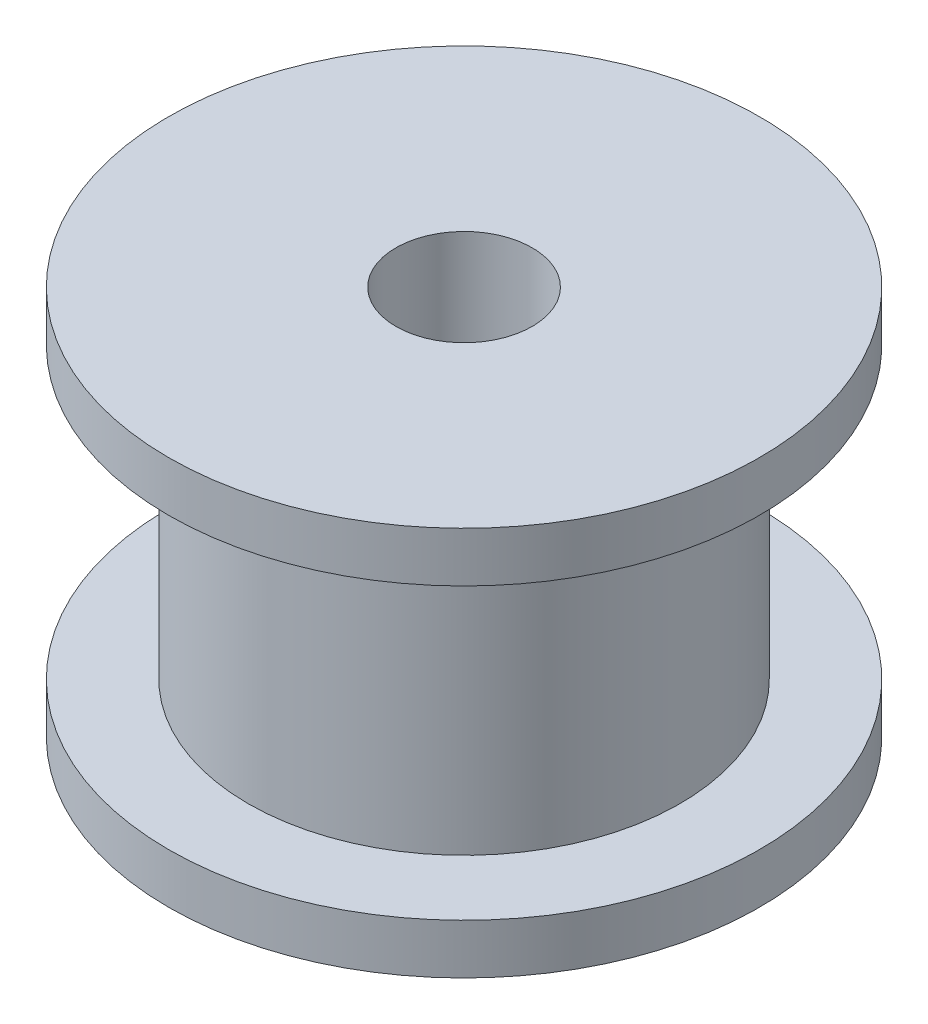
ISO-10303-21;
HEADER;
FILE_DESCRIPTION(('STEP AP214'),'2;1');
FILE_NAME('part.step','',(''),(''),'','','');
FILE_SCHEMA(('AUTOMOTIVE_DESIGN { 1 0 10303 214 1 1 1 1 }'));
ENDSEC;
DATA;
#1=APPLICATION_CONTEXT('core data for automotive mechanical design processes');
#2=APPLICATION_PROTOCOL_DEFINITION('international standard','automotive_design',2000,#1);
#3=PRODUCT_CONTEXT('',#1,'mechanical');
#4=PRODUCT('Part','Part','',(#3));
#5=PRODUCT_RELATED_PRODUCT_CATEGORY('part','',(#4));
#6=PRODUCT_DEFINITION_FORMATION('','',#4);
#7=PRODUCT_DEFINITION_CONTEXT('part definition',#1,'design');
#8=PRODUCT_DEFINITION('design','',#6,#7);
#9=PRODUCT_DEFINITION_SHAPE('','',#8);
#10=(LENGTH_UNIT() NAMED_UNIT(*) SI_UNIT(.MILLI.,.METRE.));
#11=(NAMED_UNIT(*) PLANE_ANGLE_UNIT() SI_UNIT($,.RADIAN.));
#12=(NAMED_UNIT(*) SI_UNIT($,.STERADIAN.) SOLID_ANGLE_UNIT());
#13=UNCERTAINTY_MEASURE_WITH_UNIT(LENGTH_MEASURE(1.E-05),#10,'distance_accuracy_value','');
#14=(GEOMETRIC_REPRESENTATION_CONTEXT(3) GLOBAL_UNCERTAINTY_ASSIGNED_CONTEXT((#13)) GLOBAL_UNIT_ASSIGNED_CONTEXT((#10,
#11,#12)) REPRESENTATION_CONTEXT('',''));
#15=CARTESIAN_POINT('',(0.,0.,0.));
#16=DIRECTION('',(0.,0.,1.));
#17=DIRECTION('',(1.,0.,0.));
#18=AXIS2_PLACEMENT_3D('',#15,#16,#17);
#19=CARTESIAN_POINT('',(0.,1.1,0.));
#20=DIRECTION('',(0.,-1.,0.));
#21=DIRECTION('',(0.,0.,-1.));
#22=AXIS2_PLACEMENT_3D('',#19,#20,#21);
#23=CYLINDRICAL_SURFACE('',#22,6.5);
#24=CARTESIAN_POINT('',(0.,1.1,0.));
#25=DIRECTION('',(0.,1.,0.));
#26=DIRECTION('',(0.,0.,1.));
#27=AXIS2_PLACEMENT_3D('',#24,#25,#26);
#28=CIRCLE('',#27,6.5);
#29=CARTESIAN_POINT('',(0.,1.1,6.5));
#30=VERTEX_POINT('',#29);
#31=EDGE_CURVE('E37',#30,#30,#28,.T.);
#32=ORIENTED_EDGE('',*,*,#31,.F.);
#33=EDGE_LOOP('',(#32));
#34=FACE_BOUND('',#33,.T.);
#35=CARTESIAN_POINT('',(0.,0.,0.));
#36=DIRECTION('',(0.,1.,0.));
#37=DIRECTION('',(0.,0.,1.));
#38=AXIS2_PLACEMENT_3D('',#35,#36,#37);
#39=CIRCLE('',#38,6.5);
#40=CARTESIAN_POINT('',(0.,0.,6.5));
#41=VERTEX_POINT('',#40);
#42=EDGE_CURVE('E33',#41,#41,#39,.T.);
#43=ORIENTED_EDGE('',*,*,#42,.T.);
#44=EDGE_LOOP('',(#43));
#45=FACE_BOUND('',#44,.T.);
#46=ADVANCED_FACE('F30',(#34,#45),#23,.T.);
#47=CARTESIAN_POINT('',(0.,1.1,0.));
#48=DIRECTION('',(0.,1.,0.));
#49=DIRECTION('',(0.,0.,1.));
#50=AXIS2_PLACEMENT_3D('',#47,#48,#49);
#51=PLANE('',#50);
#52=CARTESIAN_POINT('',(0.,1.1,0.));
#53=DIRECTION('',(0.,1.,0.));
#54=DIRECTION('',(0.,0.,1.));
#55=AXIS2_PLACEMENT_3D('',#52,#53,#54);
#56=CIRCLE('',#55,4.75);
#57=CARTESIAN_POINT('',(0.,1.1,4.75));
#58=VERTEX_POINT('',#57);
#59=EDGE_CURVE('E10',#58,#58,#56,.T.);
#60=ORIENTED_EDGE('',*,*,#59,.F.);
#61=EDGE_LOOP('',(#60));
#62=FACE_BOUND('',#61,.T.);
#63=ORIENTED_EDGE('',*,*,#31,.T.);
#64=EDGE_LOOP('',(#63));
#65=FACE_BOUND('',#64,.T.);
#66=ADVANCED_FACE('F88',(#62,#65),#51,.T.);
#67=CARTESIAN_POINT('',(0.,0.,0.));
#68=DIRECTION('',(0.,1.,0.));
#69=DIRECTION('',(0.,0.,1.));
#70=AXIS2_PLACEMENT_3D('',#67,#68,#69);
#71=PLANE('',#70);
#72=CARTESIAN_POINT('',(0.,0.,0.));
#73=DIRECTION('',(0.,1.,0.));
#74=DIRECTION('',(0.,0.,1.));
#75=AXIS2_PLACEMENT_3D('',#72,#73,#74);
#76=CIRCLE('',#75,1.5);
#77=CARTESIAN_POINT('',(0.,0.,1.5));
#78=VERTEX_POINT('',#77);
#79=EDGE_CURVE('E50',#78,#78,#76,.T.);
#80=ORIENTED_EDGE('',*,*,#79,.T.);
#81=EDGE_LOOP('',(#80));
#82=FACE_BOUND('',#81,.T.);
#83=ORIENTED_EDGE('',*,*,#42,.F.);
#84=EDGE_LOOP('',(#83));
#85=FACE_BOUND('',#84,.T.);
#86=ADVANCED_FACE('F59',(#82,#85),#71,.F.);
#87=CARTESIAN_POINT('',(0.,7.47,0.));
#88=DIRECTION('',(0.,-1.,0.));
#89=DIRECTION('',(0.,0.,-1.));
#90=AXIS2_PLACEMENT_3D('',#87,#88,#89);
#91=CYLINDRICAL_SURFACE('',#90,4.75);
#92=CARTESIAN_POINT('',(0.,7.47,0.));
#93=DIRECTION('',(0.,1.,0.));
#94=DIRECTION('',(0.,0.,1.));
#95=AXIS2_PLACEMENT_3D('',#92,#93,#94);
#96=CIRCLE('',#95,4.75);
#97=CARTESIAN_POINT('',(0.,7.47,4.75));
#98=VERTEX_POINT('',#97);
#99=EDGE_CURVE('E43',#98,#98,#96,.T.);
#100=ORIENTED_EDGE('',*,*,#99,.F.);
#101=EDGE_LOOP('',(#100));
#102=FACE_BOUND('',#101,.T.);
#103=ORIENTED_EDGE('',*,*,#59,.T.);
#104=EDGE_LOOP('',(#103));
#105=FACE_BOUND('',#104,.T.);
#106=ADVANCED_FACE('F78',(#102,#105),#91,.T.);
#107=CARTESIAN_POINT('',(0.,8.57,0.));
#108=DIRECTION('',(0.,-1.,0.));
#109=DIRECTION('',(0.,0.,-1.));
#110=AXIS2_PLACEMENT_3D('',#107,#108,#109);
#111=CYLINDRICAL_SURFACE('',#110,6.5);
#112=CARTESIAN_POINT('',(0.,8.57,0.));
#113=DIRECTION('',(0.,1.,0.));
#114=DIRECTION('',(0.,0.,1.));
#115=AXIS2_PLACEMENT_3D('',#112,#113,#114);
#116=CIRCLE('',#115,6.5);
#117=CARTESIAN_POINT('',(0.,8.57,6.5));
#118=VERTEX_POINT('',#117);
#119=EDGE_CURVE('E46',#118,#118,#116,.T.);
#120=ORIENTED_EDGE('',*,*,#119,.F.);
#121=EDGE_LOOP('',(#120));
#122=FACE_BOUND('',#121,.T.);
#123=CARTESIAN_POINT('',(0.,7.47,0.));
#124=DIRECTION('',(0.,1.,0.));
#125=DIRECTION('',(0.,0.,1.));
#126=AXIS2_PLACEMENT_3D('',#123,#124,#125);
#127=CIRCLE('',#126,6.5);
#128=CARTESIAN_POINT('',(0.,7.47,6.5));
#129=VERTEX_POINT('',#128);
#130=EDGE_CURVE('E47',#129,#129,#127,.T.);
#131=ORIENTED_EDGE('',*,*,#130,.T.);
#132=EDGE_LOOP('',(#131));
#133=FACE_BOUND('',#132,.T.);
#134=ADVANCED_FACE('F72',(#122,#133),#111,.T.);
#135=CARTESIAN_POINT('',(0.,8.57,0.));
#136=DIRECTION('',(0.,1.,0.));
#137=DIRECTION('',(0.,0.,1.));
#138=AXIS2_PLACEMENT_3D('',#135,#136,#137);
#139=PLANE('',#138);
#140=CARTESIAN_POINT('',(0.,8.57,0.));
#141=DIRECTION('',(0.,1.,0.));
#142=DIRECTION('',(0.,0.,1.));
#143=AXIS2_PLACEMENT_3D('',#140,#141,#142);
#144=CIRCLE('',#143,1.5);
#145=CARTESIAN_POINT('',(0.,8.57,1.5));
#146=VERTEX_POINT('',#145);
#147=EDGE_CURVE('E53',#146,#146,#144,.T.);
#148=ORIENTED_EDGE('',*,*,#147,.F.);
#149=EDGE_LOOP('',(#148));
#150=FACE_BOUND('',#149,.T.);
#151=ORIENTED_EDGE('',*,*,#119,.T.);
#152=EDGE_LOOP('',(#151));
#153=FACE_BOUND('',#152,.T.);
#154=ADVANCED_FACE('F69',(#150,#153),#139,.T.);
#155=CARTESIAN_POINT('',(0.,7.47,0.));
#156=DIRECTION('',(0.,1.,0.));
#157=DIRECTION('',(0.,0.,1.));
#158=AXIS2_PLACEMENT_3D('',#155,#156,#157);
#159=PLANE('',#158);
#160=ORIENTED_EDGE('',*,*,#99,.T.);
#161=EDGE_LOOP('',(#160));
#162=FACE_BOUND('',#161,.T.);
#163=ORIENTED_EDGE('',*,*,#130,.F.);
#164=EDGE_LOOP('',(#163));
#165=FACE_BOUND('',#164,.T.);
#166=ADVANCED_FACE('F65',(#162,#165),#159,.F.);
#167=CARTESIAN_POINT('',(0.,0.,0.));
#168=DIRECTION('',(0.,1.,0.));
#169=DIRECTION('',(0.,0.,1.));
#170=AXIS2_PLACEMENT_3D('',#167,#168,#169);
#171=CYLINDRICAL_SURFACE('',#170,1.5);
#172=ORIENTED_EDGE('',*,*,#79,.F.);
#173=EDGE_LOOP('',(#172));
#174=FACE_BOUND('',#173,.T.);
#175=ORIENTED_EDGE('',*,*,#147,.T.);
#176=EDGE_LOOP('',(#175));
#177=FACE_BOUND('',#176,.T.);
#178=ADVANCED_FACE('F62',(#174,#177),#171,.F.);
#179=CLOSED_SHELL('',(#46,#66,#86,#106,#134,#154,#166,#178));
#180=MANIFOLD_SOLID_BREP('B2',#179);
#181=ADVANCED_BREP_SHAPE_REPRESENTATION('',(#18,#180),#14);
#182=SHAPE_DEFINITION_REPRESENTATION(#9,#181);
ENDSEC;
END-ISO-10303-21;
